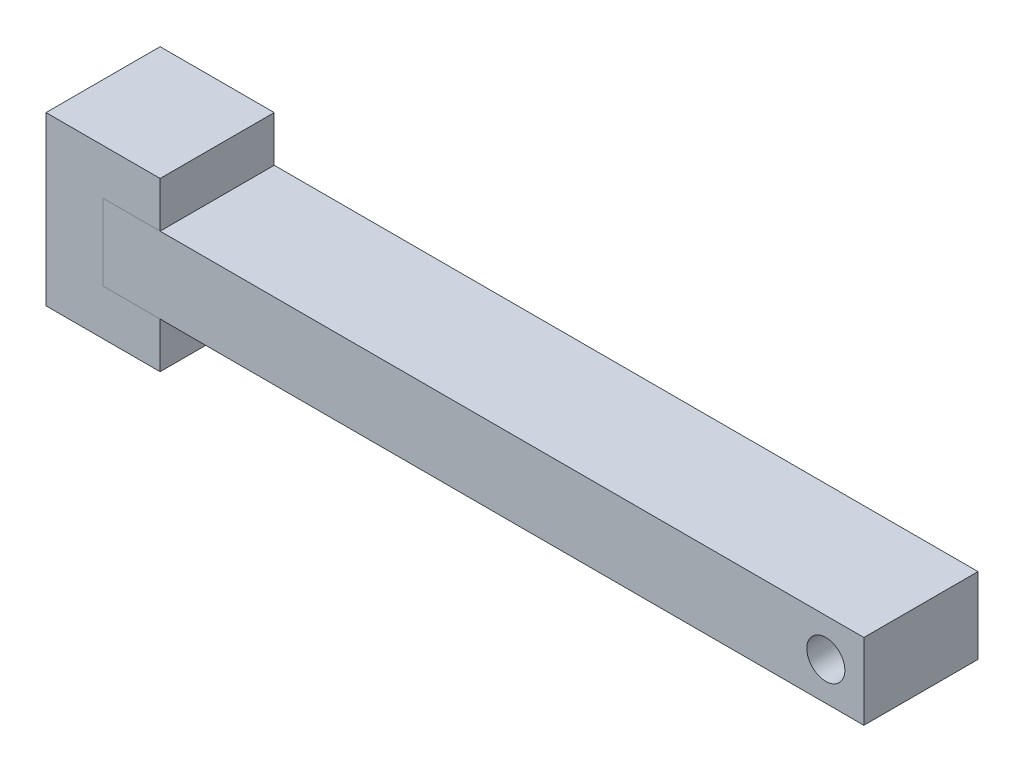
ISO-10303-21;
HEADER;
FILE_DESCRIPTION(('STEP AP214'),'2;1');
FILE_NAME('part.step','',(''),(''),'','','');
FILE_SCHEMA(('AUTOMOTIVE_DESIGN { 1 0 10303 214 1 1 1 1 }'));
ENDSEC;
DATA;
#1=APPLICATION_CONTEXT('core data for automotive mechanical design processes');
#2=APPLICATION_PROTOCOL_DEFINITION('international standard','automotive_design',2000,#1);
#3=PRODUCT_CONTEXT('',#1,'mechanical');
#4=PRODUCT('Part','Part','',(#3));
#5=PRODUCT_RELATED_PRODUCT_CATEGORY('part','',(#4));
#6=PRODUCT_DEFINITION_FORMATION('','',#4);
#7=PRODUCT_DEFINITION_CONTEXT('part definition',#1,'design');
#8=PRODUCT_DEFINITION('design','',#6,#7);
#9=PRODUCT_DEFINITION_SHAPE('','',#8);
#10=(LENGTH_UNIT() NAMED_UNIT(*) SI_UNIT(.MILLI.,.METRE.));
#11=(NAMED_UNIT(*) PLANE_ANGLE_UNIT() SI_UNIT($,.RADIAN.));
#12=(NAMED_UNIT(*) SI_UNIT($,.STERADIAN.) SOLID_ANGLE_UNIT());
#13=UNCERTAINTY_MEASURE_WITH_UNIT(LENGTH_MEASURE(1.E-05),#10,'distance_accuracy_value','');
#14=(GEOMETRIC_REPRESENTATION_CONTEXT(3) GLOBAL_UNCERTAINTY_ASSIGNED_CONTEXT((#13)) GLOBAL_UNIT_ASSIGNED_CONTEXT((#10,
#11,#12)) REPRESENTATION_CONTEXT('',''));
#15=CARTESIAN_POINT('',(0.,0.,0.));
#16=DIRECTION('',(0.,0.,1.));
#17=DIRECTION('',(1.,0.,0.));
#18=AXIS2_PLACEMENT_3D('',#15,#16,#17);
#19=CARTESIAN_POINT('',(-575.,-110.,341.270539113887));
#20=DIRECTION('',(-1.,0.,0.));
#21=DIRECTION('',(0.,0.,1.));
#22=AXIS2_PLACEMENT_3D('',#19,#20,#21);
#23=PLANE('',#22);
#24=DIRECTION('',(0.,-1.,0.));
#25=VECTOR('',#24,1.);
#26=CARTESIAN_POINT('',(-575.,-110.,75.));
#27=LINE('',#26,#25);
#28=CARTESIAN_POINT('',(-575.,110.,75.));
#29=VERTEX_POINT('',#28);
#30=CARTESIAN_POINT('',(-575.,-110.,75.));
#31=VERTEX_POINT('',#30);
#32=EDGE_CURVE('E59',#29,#31,#27,.T.);
#33=ORIENTED_EDGE('',*,*,#32,.F.);
#34=DIRECTION('',(0.,0.,-1.));
#35=VECTOR('',#34,1.);
#36=CARTESIAN_POINT('',(-575.,110.,341.270539113887));
#37=LINE('',#36,#35);
#38=CARTESIAN_POINT('',(-575.,110.,-75.));
#39=VERTEX_POINT('',#38);
#40=EDGE_CURVE('E87',#29,#39,#37,.T.);
#41=ORIENTED_EDGE('',*,*,#40,.T.);
#42=DIRECTION('',(0.,1.,0.));
#43=VECTOR('',#42,1.);
#44=CARTESIAN_POINT('',(-575.,-110.,-75.));
#45=LINE('',#44,#43);
#46=CARTESIAN_POINT('',(-575.,-110.,-75.));
#47=VERTEX_POINT('',#46);
#48=EDGE_CURVE('E91',#47,#39,#45,.T.);
#49=ORIENTED_EDGE('',*,*,#48,.F.);
#50=DIRECTION('',(0.,0.,-1.));
#51=VECTOR('',#50,1.);
#52=CARTESIAN_POINT('',(-575.,-110.,341.270539113887));
#53=LINE('',#52,#51);
#54=EDGE_CURVE('E114',#31,#47,#53,.T.);
#55=ORIENTED_EDGE('',*,*,#54,.F.);
#56=EDGE_LOOP('',(#33,#41,#49,#55));
#57=FACE_BOUND('',#56,.T.);
#58=ADVANCED_FACE('F51',(#57),#23,.T.);
#59=CARTESIAN_POINT('',(-425.,-110.,341.270539113887));
#60=DIRECTION('',(0.,-1.,0.));
#61=DIRECTION('',(0.,0.,-1.));
#62=AXIS2_PLACEMENT_3D('',#59,#60,#61);
#63=PLANE('',#62);
#64=DIRECTION('',(1.,0.,0.));
#65=VECTOR('',#64,1.);
#66=CARTESIAN_POINT('',(-425.,-110.,75.));
#67=LINE('',#66,#65);
#68=CARTESIAN_POINT('',(-425.,-110.,75.));
#69=VERTEX_POINT('',#68);
#70=EDGE_CURVE('E65',#31,#69,#67,.T.);
#71=ORIENTED_EDGE('',*,*,#70,.F.);
#72=ORIENTED_EDGE('',*,*,#54,.T.);
#73=DIRECTION('',(-1.,0.,0.));
#74=VECTOR('',#73,1.);
#75=CARTESIAN_POINT('',(-425.,-110.,-75.));
#76=LINE('',#75,#74);
#77=CARTESIAN_POINT('',(-425.,-110.,-75.));
#78=VERTEX_POINT('',#77);
#79=EDGE_CURVE('E96',#78,#47,#76,.T.);
#80=ORIENTED_EDGE('',*,*,#79,.F.);
#81=DIRECTION('',(0.,0.,-1.));
#82=VECTOR('',#81,1.);
#83=CARTESIAN_POINT('',(-425.,-110.,341.270539113887));
#84=LINE('',#83,#82);
#85=EDGE_CURVE('E117',#69,#78,#84,.T.);
#86=ORIENTED_EDGE('',*,*,#85,.F.);
#87=EDGE_LOOP('',(#71,#72,#80,#86));
#88=FACE_BOUND('',#87,.T.);
#89=ADVANCED_FACE('F123',(#88),#63,.T.);
#90=CARTESIAN_POINT('',(-425.,-110.,341.270539113887));
#91=DIRECTION('',(1.,0.,0.));
#92=DIRECTION('',(0.,0.,-1.));
#93=AXIS2_PLACEMENT_3D('',#90,#91,#92);
#94=PLANE('',#93);
#95=DIRECTION('',(0.,1.,0.));
#96=VECTOR('',#95,1.);
#97=CARTESIAN_POINT('',(-425.,-110.,75.));
#98=LINE('',#97,#96);
#99=CARTESIAN_POINT('',(-425.,110.,75.0000000000001));
#100=VERTEX_POINT('',#99);
#101=EDGE_CURVE('E116',#69,#100,#98,.T.);
#102=ORIENTED_EDGE('',*,*,#101,.F.);
#103=ORIENTED_EDGE('',*,*,#85,.T.);
#104=DIRECTION('',(0.,-1.,0.));
#105=VECTOR('',#104,1.);
#106=CARTESIAN_POINT('',(-425.,-110.,-75.));
#107=LINE('',#106,#105);
#108=CARTESIAN_POINT('',(-425.,110.,-75.));
#109=VERTEX_POINT('',#108);
#110=EDGE_CURVE('E104',#109,#78,#107,.T.);
#111=ORIENTED_EDGE('',*,*,#110,.F.);
#112=DIRECTION('',(0.,0.,-1.));
#113=VECTOR('',#112,1.);
#114=CARTESIAN_POINT('',(-425.,110.,341.270539113887));
#115=LINE('',#114,#113);
#116=EDGE_CURVE('E95',#100,#109,#115,.T.);
#117=ORIENTED_EDGE('',*,*,#116,.F.);
#118=EDGE_LOOP('',(#102,#103,#111,#117));
#119=FACE_BOUND('',#118,.T.);
#120=ADVANCED_FACE('F121',(#119),#94,.T.);
#121=CARTESIAN_POINT('',(-425.,110.,341.270539113887));
#122=DIRECTION('',(0.,1.,0.));
#123=DIRECTION('',(0.,0.,1.));
#124=AXIS2_PLACEMENT_3D('',#121,#122,#123);
#125=PLANE('',#124);
#126=DIRECTION('',(-1.,0.,0.));
#127=VECTOR('',#126,1.);
#128=CARTESIAN_POINT('',(-425.,110.,75.));
#129=LINE('',#128,#127);
#130=EDGE_CURVE('E12',#100,#29,#129,.T.);
#131=ORIENTED_EDGE('',*,*,#130,.F.);
#132=ORIENTED_EDGE('',*,*,#116,.T.);
#133=DIRECTION('',(1.,0.,0.));
#134=VECTOR('',#133,1.);
#135=CARTESIAN_POINT('',(-425.,110.,-75.));
#136=LINE('',#135,#134);
#137=EDGE_CURVE('E98',#39,#109,#136,.T.);
#138=ORIENTED_EDGE('',*,*,#137,.F.);
#139=ORIENTED_EDGE('',*,*,#40,.F.);
#140=EDGE_LOOP('',(#131,#132,#138,#139));
#141=FACE_BOUND('',#140,.T.);
#142=ADVANCED_FACE('F99',(#141),#125,.T.);
#143=CARTESIAN_POINT('',(0.,0.,-75.));
#144=DIRECTION('',(0.,0.,1.));
#145=DIRECTION('',(1.,0.,0.));
#146=AXIS2_PLACEMENT_3D('',#143,#144,#145);
#147=PLANE('',#146);
#148=ORIENTED_EDGE('',*,*,#48,.T.);
#149=ORIENTED_EDGE('',*,*,#137,.T.);
#150=ORIENTED_EDGE('',*,*,#110,.T.);
#151=ORIENTED_EDGE('',*,*,#79,.T.);
#152=EDGE_LOOP('',(#148,#149,#150,#151));
#153=FACE_BOUND('',#152,.T.);
#154=ADVANCED_FACE('F106',(#153),#147,.F.);
#155=CARTESIAN_POINT('',(-500.,50.,75.));
#156=DIRECTION('',(0.,0.,-1.));
#157=DIRECTION('',(-1.,0.,0.));
#158=AXIS2_PLACEMENT_3D('',#155,#156,#157);
#159=PLANE('',#158);
#160=ORIENTED_EDGE('',*,*,#32,.T.);
#161=ORIENTED_EDGE('',*,*,#70,.T.);
#162=ORIENTED_EDGE('',*,*,#101,.T.);
#163=ORIENTED_EDGE('',*,*,#130,.T.);
#164=EDGE_LOOP('',(#160,#161,#162,#163));
#165=FACE_BOUND('',#164,.T.);
#166=ADVANCED_FACE('F125',(#165),#159,.F.);
#167=CLOSED_SHELL('',(#58,#89,#120,#142,#154,#166));
#168=MANIFOLD_SOLID_BREP('B2',#167);
#169=CARTESIAN_POINT('',(500.,50.,75.));
#170=DIRECTION('',(-1.,0.,0.));
#171=DIRECTION('',(0.,0.,1.));
#172=AXIS2_PLACEMENT_3D('',#169,#170,#171);
#173=PLANE('',#172);
#174=DIRECTION('',(0.,0.,-1.));
#175=VECTOR('',#174,1.);
#176=CARTESIAN_POINT('',(500.,-50.,75.));
#177=LINE('',#176,#175);
#178=CARTESIAN_POINT('',(500.,-50.,75.));
#179=VERTEX_POINT('',#178);
#180=CARTESIAN_POINT('',(500.,-50.,-75.));
#181=VERTEX_POINT('',#180);
#182=EDGE_CURVE('E250',#179,#181,#177,.T.);
#183=ORIENTED_EDGE('',*,*,#182,.T.);
#184=DIRECTION('',(0.,-1.,0.));
#185=VECTOR('',#184,1.);
#186=CARTESIAN_POINT('',(500.,50.,-75.));
#187=LINE('',#186,#185);
#188=CARTESIAN_POINT('',(500.,50.,-75.));
#189=VERTEX_POINT('',#188);
#190=EDGE_CURVE('E49',#189,#181,#187,.T.);
#191=ORIENTED_EDGE('',*,*,#190,.F.);
#192=DIRECTION('',(0.,0.,-1.));
#193=VECTOR('',#192,1.);
#194=CARTESIAN_POINT('',(500.,50.,75.));
#195=LINE('',#194,#193);
#196=CARTESIAN_POINT('',(500.,50.,75.));
#197=VERTEX_POINT('',#196);
#198=EDGE_CURVE('E238',#197,#189,#195,.T.);
#199=ORIENTED_EDGE('',*,*,#198,.F.);
#200=DIRECTION('',(0.,-1.,0.));
#201=VECTOR('',#200,1.);
#202=CARTESIAN_POINT('',(500.,50.,75.));
#203=LINE('',#202,#201);
#204=EDGE_CURVE('E246',#197,#179,#203,.T.);
#205=ORIENTED_EDGE('',*,*,#204,.T.);
#206=EDGE_LOOP('',(#183,#191,#199,#205));
#207=FACE_BOUND('',#206,.T.);
#208=ADVANCED_FACE('F187',(#207),#173,.F.);
#209=CARTESIAN_POINT('',(-500.,50.,-75.));
#210=DIRECTION('',(0.,0.,1.));
#211=DIRECTION('',(1.,0.,0.));
#212=AXIS2_PLACEMENT_3D('',#209,#210,#211);
#213=PLANE('',#212);
#214=CARTESIAN_POINT('',(450.,0.,-75.));
#215=DIRECTION('',(0.,0.,1.));
#216=DIRECTION('',(1.,0.,0.));
#217=AXIS2_PLACEMENT_3D('',#214,#215,#216);
#218=CIRCLE('',#217,24.9999999999999);
#219=CARTESIAN_POINT('',(475.,0.,-75.));
#220=VERTEX_POINT('',#219);
#221=EDGE_CURVE('E253',#220,#220,#218,.T.);
#222=ORIENTED_EDGE('',*,*,#221,.T.);
#223=EDGE_LOOP('',(#222));
#224=FACE_BOUND('',#223,.T.);
#225=DIRECTION('',(-1.,0.,0.));
#226=VECTOR('',#225,1.);
#227=CARTESIAN_POINT('',(-500.,-50.,-75.));
#228=LINE('',#227,#226);
#229=CARTESIAN_POINT('',(-500.,-50.,-75.));
#230=VERTEX_POINT('',#229);
#231=EDGE_CURVE('E242',#181,#230,#228,.T.);
#232=ORIENTED_EDGE('',*,*,#231,.T.);
#233=DIRECTION('',(0.,-1.,0.));
#234=VECTOR('',#233,1.);
#235=CARTESIAN_POINT('',(-500.,50.,-75.));
#236=LINE('',#235,#234);
#237=CARTESIAN_POINT('',(-500.,50.,-75.));
#238=VERTEX_POINT('',#237);
#239=EDGE_CURVE('E195',#238,#230,#236,.T.);
#240=ORIENTED_EDGE('',*,*,#239,.F.);
#241=DIRECTION('',(-1.,0.,0.));
#242=VECTOR('',#241,1.);
#243=CARTESIAN_POINT('',(-500.,50.,-75.));
#244=LINE('',#243,#242);
#245=EDGE_CURVE('E233',#189,#238,#244,.T.);
#246=ORIENTED_EDGE('',*,*,#245,.F.);
#247=ORIENTED_EDGE('',*,*,#190,.T.);
#248=EDGE_LOOP('',(#232,#240,#246,#247));
#249=FACE_BOUND('',#248,.T.);
#250=ADVANCED_FACE('F241',(#224,#249),#213,.F.);
#251=CARTESIAN_POINT('',(-500.,50.,75.));
#252=DIRECTION('',(1.,0.,0.));
#253=DIRECTION('',(0.,0.,-1.));
#254=AXIS2_PLACEMENT_3D('',#251,#252,#253);
#255=PLANE('',#254);
#256=DIRECTION('',(0.,0.,1.));
#257=VECTOR('',#256,1.);
#258=CARTESIAN_POINT('',(-500.,-50.,75.));
#259=LINE('',#258,#257);
#260=CARTESIAN_POINT('',(-500.,-50.,75.));
#261=VERTEX_POINT('',#260);
#262=EDGE_CURVE('E220',#230,#261,#259,.T.);
#263=ORIENTED_EDGE('',*,*,#262,.T.);
#264=DIRECTION('',(0.,-1.,0.));
#265=VECTOR('',#264,1.);
#266=CARTESIAN_POINT('',(-500.,50.,75.));
#267=LINE('',#266,#265);
#268=CARTESIAN_POINT('',(-500.,50.,75.));
#269=VERTEX_POINT('',#268);
#270=EDGE_CURVE('E243',#269,#261,#267,.T.);
#271=ORIENTED_EDGE('',*,*,#270,.F.);
#272=DIRECTION('',(0.,0.,1.));
#273=VECTOR('',#272,1.);
#274=CARTESIAN_POINT('',(-500.,50.,75.));
#275=LINE('',#274,#273);
#276=EDGE_CURVE('E236',#238,#269,#275,.T.);
#277=ORIENTED_EDGE('',*,*,#276,.F.);
#278=ORIENTED_EDGE('',*,*,#239,.T.);
#279=EDGE_LOOP('',(#263,#271,#277,#278));
#280=FACE_BOUND('',#279,.T.);
#281=ADVANCED_FACE('F244',(#280),#255,.F.);
#282=CARTESIAN_POINT('',(-500.,50.,75.));
#283=DIRECTION('',(0.,0.,-1.));
#284=DIRECTION('',(-1.,0.,0.));
#285=AXIS2_PLACEMENT_3D('',#282,#283,#284);
#286=PLANE('',#285);
#287=CARTESIAN_POINT('',(450.,0.,75.));
#288=DIRECTION('',(0.,0.,1.));
#289=DIRECTION('',(1.,0.,0.));
#290=AXIS2_PLACEMENT_3D('',#287,#288,#289);
#291=CIRCLE('',#290,24.9999999999999);
#292=CARTESIAN_POINT('',(475.,0.,75.));
#293=VERTEX_POINT('',#292);
#294=EDGE_CURVE('E264',#293,#293,#291,.T.);
#295=ORIENTED_EDGE('',*,*,#294,.F.);
#296=EDGE_LOOP('',(#295));
#297=FACE_BOUND('',#296,.T.);
#298=DIRECTION('',(1.,0.,0.));
#299=VECTOR('',#298,1.);
#300=CARTESIAN_POINT('',(-500.,-50.,75.));
#301=LINE('',#300,#299);
#302=EDGE_CURVE('E226',#261,#179,#301,.T.);
#303=ORIENTED_EDGE('',*,*,#302,.T.);
#304=ORIENTED_EDGE('',*,*,#204,.F.);
#305=DIRECTION('',(1.,0.,0.));
#306=VECTOR('',#305,1.);
#307=CARTESIAN_POINT('',(-500.,50.,75.));
#308=LINE('',#307,#306);
#309=EDGE_CURVE('E203',#269,#197,#308,.T.);
#310=ORIENTED_EDGE('',*,*,#309,.F.);
#311=ORIENTED_EDGE('',*,*,#270,.T.);
#312=EDGE_LOOP('',(#303,#304,#310,#311));
#313=FACE_BOUND('',#312,.T.);
#314=ADVANCED_FACE('F258',(#297,#313),#286,.F.);
#315=CARTESIAN_POINT('',(0.,50.,0.));
#316=DIRECTION('',(0.,-1.,0.));
#317=DIRECTION('',(0.,0.,-1.));
#318=AXIS2_PLACEMENT_3D('',#315,#316,#317);
#319=PLANE('',#318);
#320=ORIENTED_EDGE('',*,*,#198,.T.);
#321=ORIENTED_EDGE('',*,*,#245,.T.);
#322=ORIENTED_EDGE('',*,*,#276,.T.);
#323=ORIENTED_EDGE('',*,*,#309,.T.);
#324=EDGE_LOOP('',(#320,#321,#322,#323));
#325=FACE_BOUND('',#324,.T.);
#326=ADVANCED_FACE('F234',(#325),#319,.F.);
#327=CARTESIAN_POINT('',(0.,-50.,0.));
#328=DIRECTION('',(0.,-1.,0.));
#329=DIRECTION('',(0.,0.,-1.));
#330=AXIS2_PLACEMENT_3D('',#327,#328,#329);
#331=PLANE('',#330);
#332=ORIENTED_EDGE('',*,*,#182,.F.);
#333=ORIENTED_EDGE('',*,*,#302,.F.);
#334=ORIENTED_EDGE('',*,*,#262,.F.);
#335=ORIENTED_EDGE('',*,*,#231,.F.);
#336=EDGE_LOOP('',(#332,#333,#334,#335));
#337=FACE_BOUND('',#336,.T.);
#338=ADVANCED_FACE('F261',(#337),#331,.T.);
#339=CARTESIAN_POINT('',(450.,0.,-75.));
#340=DIRECTION('',(0.,0.,1.));
#341=DIRECTION('',(1.,0.,0.));
#342=AXIS2_PLACEMENT_3D('',#339,#340,#341);
#343=CYLINDRICAL_SURFACE('',#342,24.9999999999999);
#344=ORIENTED_EDGE('',*,*,#221,.F.);
#345=EDGE_LOOP('',(#344));
#346=FACE_BOUND('',#345,.T.);
#347=ORIENTED_EDGE('',*,*,#294,.T.);
#348=EDGE_LOOP('',(#347));
#349=FACE_BOUND('',#348,.T.);
#350=ADVANCED_FACE('F271',(#346,#349),#343,.F.);
#351=CLOSED_SHELL('',(#208,#250,#281,#314,#326,#338,#350));
#352=MANIFOLD_SOLID_BREP('B6',#351);
#353=ADVANCED_BREP_SHAPE_REPRESENTATION('',(#18,#168,#352),#14);
#354=SHAPE_DEFINITION_REPRESENTATION(#9,#353);
ENDSEC;
END-ISO-10303-21;
